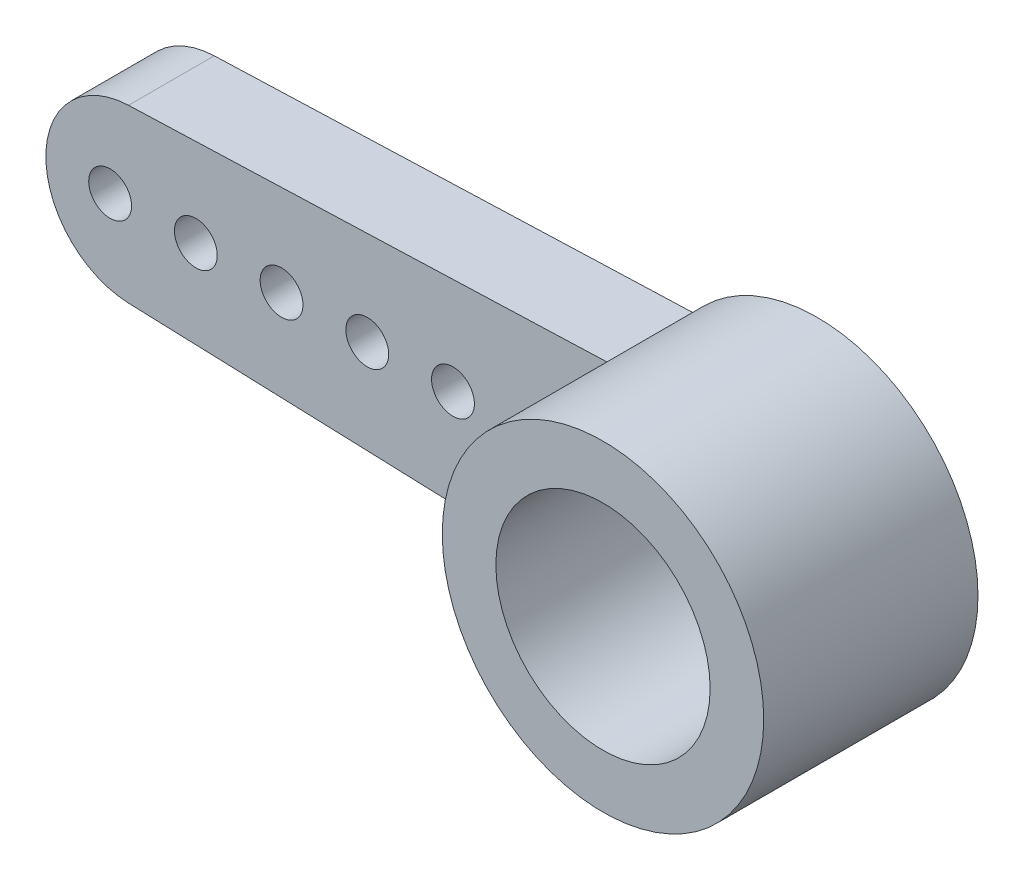
ISO-10303-21;
HEADER;
FILE_DESCRIPTION(('STEP AP214'),'2;1');
FILE_NAME('part.step','',(''),(''),'','','');
FILE_SCHEMA(('AUTOMOTIVE_DESIGN { 1 0 10303 214 1 1 1 1 }'));
ENDSEC;
DATA;
#1=APPLICATION_CONTEXT('core data for automotive mechanical design processes');
#2=APPLICATION_PROTOCOL_DEFINITION('international standard','automotive_design',2000,#1);
#3=PRODUCT_CONTEXT('',#1,'mechanical');
#4=PRODUCT('Part','Part','',(#3));
#5=PRODUCT_RELATED_PRODUCT_CATEGORY('part','',(#4));
#6=PRODUCT_DEFINITION_FORMATION('','',#4);
#7=PRODUCT_DEFINITION_CONTEXT('part definition',#1,'design');
#8=PRODUCT_DEFINITION('design','',#6,#7);
#9=PRODUCT_DEFINITION_SHAPE('','',#8);
#10=(LENGTH_UNIT() NAMED_UNIT(*) SI_UNIT(.MILLI.,.METRE.));
#11=(NAMED_UNIT(*) PLANE_ANGLE_UNIT() SI_UNIT($,.RADIAN.));
#12=(NAMED_UNIT(*) SI_UNIT($,.STERADIAN.) SOLID_ANGLE_UNIT());
#13=UNCERTAINTY_MEASURE_WITH_UNIT(LENGTH_MEASURE(1.E-05),#10,'distance_accuracy_value','');
#14=(GEOMETRIC_REPRESENTATION_CONTEXT(3) GLOBAL_UNCERTAINTY_ASSIGNED_CONTEXT((#13)) GLOBAL_UNIT_ASSIGNED_CONTEXT((#10,
#11,#12)) REPRESENTATION_CONTEXT('',''));
#15=CARTESIAN_POINT('',(0.,0.,0.));
#16=DIRECTION('',(0.,0.,1.));
#17=DIRECTION('',(1.,0.,0.));
#18=AXIS2_PLACEMENT_3D('',#15,#16,#17);
#19=CARTESIAN_POINT('',(0.,0.,0.));
#20=DIRECTION('',(0.,0.,1.));
#21=DIRECTION('',(1.,0.,0.));
#22=AXIS2_PLACEMENT_3D('',#19,#20,#21);
#23=PLANE('',#22);
#24=CARTESIAN_POINT('',(-14.5,0.,0.));
#25=DIRECTION('',(0.,0.,-1.));
#26=DIRECTION('',(-1.,0.,0.));
#27=AXIS2_PLACEMENT_3D('',#24,#25,#26);
#28=CIRCLE('',#27,0.500000000000001);
#29=CARTESIAN_POINT('',(-15.,0.,0.));
#30=VERTEX_POINT('',#29);
#31=EDGE_CURVE('E159',#30,#30,#28,.F.);
#32=ORIENTED_EDGE('',*,*,#31,.T.);
#33=EDGE_LOOP('',(#32));
#34=FACE_BOUND('',#33,.T.);
#35=CARTESIAN_POINT('',(-10.5,0.,0.));
#36=DIRECTION('',(0.,0.,-1.));
#37=DIRECTION('',(-1.,0.,0.));
#38=AXIS2_PLACEMENT_3D('',#35,#36,#37);
#39=CIRCLE('',#38,0.500000000000001);
#40=CARTESIAN_POINT('',(-11.,0.,0.));
#41=VERTEX_POINT('',#40);
#42=EDGE_CURVE('E147',#41,#41,#39,.F.);
#43=ORIENTED_EDGE('',*,*,#42,.T.);
#44=EDGE_LOOP('',(#43));
#45=FACE_BOUND('',#44,.T.);
#46=CARTESIAN_POINT('',(-6.5,0.,0.));
#47=DIRECTION('',(0.,0.,-1.));
#48=DIRECTION('',(-1.,0.,0.));
#49=AXIS2_PLACEMENT_3D('',#46,#47,#48);
#50=CIRCLE('',#49,0.500000000000001);
#51=CARTESIAN_POINT('',(-7.,0.,0.));
#52=VERTEX_POINT('',#51);
#53=EDGE_CURVE('E135',#52,#52,#50,.F.);
#54=ORIENTED_EDGE('',*,*,#53,.T.);
#55=EDGE_LOOP('',(#54));
#56=FACE_BOUND('',#55,.T.);
#57=CARTESIAN_POINT('',(-4.5,0.,0.));
#58=DIRECTION('',(0.,0.,-1.));
#59=DIRECTION('',(-1.,0.,0.));
#60=AXIS2_PLACEMENT_3D('',#57,#58,#59);
#61=CIRCLE('',#60,0.500000000000001);
#62=CARTESIAN_POINT('',(-5.,0.,0.));
#63=VERTEX_POINT('',#62);
#64=EDGE_CURVE('E131',#63,#63,#61,.F.);
#65=ORIENTED_EDGE('',*,*,#64,.T.);
#66=EDGE_LOOP('',(#65));
#67=FACE_BOUND('',#66,.T.);
#68=CARTESIAN_POINT('',(-8.5,0.,0.));
#69=DIRECTION('',(0.,0.,-1.));
#70=DIRECTION('',(-1.,0.,0.));
#71=AXIS2_PLACEMENT_3D('',#68,#69,#70);
#72=CIRCLE('',#71,0.500000000000001);
#73=CARTESIAN_POINT('',(-9.,0.,0.));
#74=VERTEX_POINT('',#73);
#75=EDGE_CURVE('E141',#74,#74,#72,.F.);
#76=ORIENTED_EDGE('',*,*,#75,.T.);
#77=EDGE_LOOP('',(#76));
#78=FACE_BOUND('',#77,.T.);
#79=CARTESIAN_POINT('',(-12.5,0.,0.));
#80=DIRECTION('',(0.,0.,-1.));
#81=DIRECTION('',(-1.,0.,0.));
#82=AXIS2_PLACEMENT_3D('',#79,#80,#81);
#83=CIRCLE('',#82,0.500000000000001);
#84=CARTESIAN_POINT('',(-13.,0.,0.));
#85=VERTEX_POINT('',#84);
#86=EDGE_CURVE('E153',#85,#85,#83,.F.);
#87=ORIENTED_EDGE('',*,*,#86,.T.);
#88=EDGE_LOOP('',(#87));
#89=FACE_BOUND('',#88,.T.);
#90=CARTESIAN_POINT('',(0.,0.,0.));
#91=DIRECTION('',(0.,0.,-1.));
#92=DIRECTION('',(-1.,0.,0.));
#93=AXIS2_PLACEMENT_3D('',#90,#91,#92);
#94=CIRCLE('',#93,2.5);
#95=CARTESIAN_POINT('',(-2.5,0.,0.));
#96=VERTEX_POINT('',#95);
#97=EDGE_CURVE('E171',#96,#96,#94,.T.);
#98=ORIENTED_EDGE('',*,*,#97,.F.);
#99=EDGE_LOOP('',(#98));
#100=FACE_BOUND('',#99,.T.);
#101=DIRECTION('',(0.999372730394994,0.0354139201848026,0.));
#102=VECTOR('',#101,1.);
#103=CARTESIAN_POINT('',(-0.0883858807695831,2.49422934631706,0.));
#104=LINE('',#103,#102);
#105=CARTESIAN_POINT('',(-14.0708278403696,1.99874546078999,0.));
#106=VERTEX_POINT('',#105);
#107=CARTESIAN_POINT('',(-2.88547071027724,2.39511143376089,0.));
#108=VERTEX_POINT('',#107);
#109=EDGE_CURVE('E119',#106,#108,#104,.T.);
#110=ORIENTED_EDGE('',*,*,#109,.T.);
#111=CARTESIAN_POINT('',(0.,0.,0.));
#112=DIRECTION('',(0.,0.,-1.));
#113=DIRECTION('',(-1.,0.,0.));
#114=AXIS2_PLACEMENT_3D('',#111,#112,#113);
#115=CIRCLE('',#114,3.75);
#116=CARTESIAN_POINT('',(-2.88547071027724,-2.39511143376089,0.));
#117=VERTEX_POINT('',#116);
#118=EDGE_CURVE('E48',#108,#117,#115,.T.);
#119=ORIENTED_EDGE('',*,*,#118,.T.);
#120=DIRECTION('',(0.999372730394994,-0.0354139201848024,0.));
#121=VECTOR('',#120,1.);
#122=CARTESIAN_POINT('',(-0.0883858807695825,-2.49422934631706,0.));
#123=LINE('',#122,#121);
#124=CARTESIAN_POINT('',(-14.0708278403696,-1.99874546078999,0.));
#125=VERTEX_POINT('',#124);
#126=EDGE_CURVE('E100',#125,#117,#123,.T.);
#127=ORIENTED_EDGE('',*,*,#126,.F.);
#128=CARTESIAN_POINT('',(-14.,0.,0.));
#129=DIRECTION('',(0.,0.,1.));
#130=DIRECTION('',(1.,0.,0.));
#131=AXIS2_PLACEMENT_3D('',#128,#129,#130);
#132=CIRCLE('',#131,2.);
#133=EDGE_CURVE('E122',#125,#106,#132,.F.);
#134=ORIENTED_EDGE('',*,*,#133,.T.);
#135=EDGE_LOOP('',(#110,#119,#127,#134));
#136=FACE_BOUND('',#135,.T.);
#137=ADVANCED_FACE('F40',(#34,#45,#56,#67,#78,#89,#100,#136),#23,.F.);
#138=CARTESIAN_POINT('',(0.,0.,0.));
#139=DIRECTION('',(0.,0.,1.));
#140=DIRECTION('',(1.,0.,0.));
#141=AXIS2_PLACEMENT_3D('',#138,#139,#140);
#142=CYLINDRICAL_SURFACE('',#141,2.5);
#143=CARTESIAN_POINT('',(0.,0.,5.));
#144=DIRECTION('',(0.,0.,1.));
#145=DIRECTION('',(1.,0.,0.));
#146=AXIS2_PLACEMENT_3D('',#143,#144,#145);
#147=CIRCLE('',#146,2.5);
#148=CARTESIAN_POINT('',(2.5,0.,5.));
#149=VERTEX_POINT('',#148);
#150=EDGE_CURVE('E128',#149,#149,#147,.T.);
#151=ORIENTED_EDGE('',*,*,#150,.T.);
#152=EDGE_LOOP('',(#151));
#153=FACE_BOUND('',#152,.T.);
#154=CARTESIAN_POINT('',(0.,0.,1.));
#155=DIRECTION('',(0.,0.,-1.));
#156=DIRECTION('',(-1.,0.,0.));
#157=AXIS2_PLACEMENT_3D('',#154,#155,#156);
#158=CIRCLE('',#157,2.5);
#159=CARTESIAN_POINT('',(-2.5,0.,1.));
#160=VERTEX_POINT('',#159);
#161=EDGE_CURVE('E165',#160,#160,#158,.T.);
#162=ORIENTED_EDGE('',*,*,#161,.T.);
#163=EDGE_LOOP('',(#162));
#164=FACE_BOUND('',#163,.T.);
#165=ADVANCED_FACE('F201',(#153,#164),#142,.F.);
#166=CARTESIAN_POINT('',(0.,0.,2.));
#167=DIRECTION('',(0.,0.,1.));
#168=DIRECTION('',(1.,0.,0.));
#169=AXIS2_PLACEMENT_3D('',#166,#167,#168);
#170=PLANE('',#169);
#171=CARTESIAN_POINT('',(-12.5,0.,2.));
#172=DIRECTION('',(0.,0.,-1.));
#173=DIRECTION('',(-1.,0.,0.));
#174=AXIS2_PLACEMENT_3D('',#171,#172,#173);
#175=CIRCLE('',#174,0.500000000000001);
#176=CARTESIAN_POINT('',(-13.,0.,2.));
#177=VERTEX_POINT('',#176);
#178=EDGE_CURVE('E156',#177,#177,#175,.F.);
#179=ORIENTED_EDGE('',*,*,#178,.F.);
#180=EDGE_LOOP('',(#179));
#181=FACE_BOUND('',#180,.T.);
#182=CARTESIAN_POINT('',(-8.5,0.,2.));
#183=DIRECTION('',(0.,0.,-1.));
#184=DIRECTION('',(-1.,0.,0.));
#185=AXIS2_PLACEMENT_3D('',#182,#183,#184);
#186=CIRCLE('',#185,0.500000000000001);
#187=CARTESIAN_POINT('',(-9.,0.,2.));
#188=VERTEX_POINT('',#187);
#189=EDGE_CURVE('E144',#188,#188,#186,.F.);
#190=ORIENTED_EDGE('',*,*,#189,.F.);
#191=EDGE_LOOP('',(#190));
#192=FACE_BOUND('',#191,.T.);
#193=CARTESIAN_POINT('',(-4.5,0.,2.));
#194=DIRECTION('',(0.,0.,-1.));
#195=DIRECTION('',(-1.,0.,0.));
#196=AXIS2_PLACEMENT_3D('',#193,#194,#195);
#197=CIRCLE('',#196,0.500000000000001);
#198=CARTESIAN_POINT('',(-5.,0.,2.));
#199=VERTEX_POINT('',#198);
#200=EDGE_CURVE('E132',#199,#199,#197,.F.);
#201=ORIENTED_EDGE('',*,*,#200,.F.);
#202=EDGE_LOOP('',(#201));
#203=FACE_BOUND('',#202,.T.);
#204=CARTESIAN_POINT('',(0.,0.,2.));
#205=DIRECTION('',(0.,0.,1.));
#206=DIRECTION('',(1.,0.,0.));
#207=AXIS2_PLACEMENT_3D('',#204,#205,#206);
#208=CIRCLE('',#207,3.75);
#209=CARTESIAN_POINT('',(-2.88547071027724,2.39511143376089,2.));
#210=VERTEX_POINT('',#209);
#211=CARTESIAN_POINT('',(-2.88547071027724,-2.39511143376089,2.));
#212=VERTEX_POINT('',#211);
#213=EDGE_CURVE('E12',#210,#212,#208,.T.);
#214=ORIENTED_EDGE('',*,*,#213,.F.);
#215=DIRECTION('',(0.999372730394994,0.0354139201848026,0.));
#216=VECTOR('',#215,1.);
#217=CARTESIAN_POINT('',(-0.0883858807695831,2.49422934631706,2.));
#218=LINE('',#217,#216);
#219=CARTESIAN_POINT('',(-14.0708278403696,1.99874546078999,2.));
#220=VERTEX_POINT('',#219);
#221=EDGE_CURVE('E95',#220,#210,#218,.T.);
#222=ORIENTED_EDGE('',*,*,#221,.F.);
#223=CARTESIAN_POINT('',(-14.,0.,2.));
#224=DIRECTION('',(0.,0.,1.));
#225=DIRECTION('',(1.,0.,0.));
#226=AXIS2_PLACEMENT_3D('',#223,#224,#225);
#227=CIRCLE('',#226,2.);
#228=CARTESIAN_POINT('',(-14.0708278403696,-1.99874546078999,2.));
#229=VERTEX_POINT('',#228);
#230=EDGE_CURVE('E93',#229,#220,#227,.F.);
#231=ORIENTED_EDGE('',*,*,#230,.F.);
#232=DIRECTION('',(0.999372730394994,-0.0354139201848024,0.));
#233=VECTOR('',#232,1.);
#234=CARTESIAN_POINT('',(-0.0883858807695825,-2.49422934631706,2.));
#235=LINE('',#234,#233);
#236=EDGE_CURVE('E88',#229,#212,#235,.T.);
#237=ORIENTED_EDGE('',*,*,#236,.T.);
#238=EDGE_LOOP('',(#214,#222,#231,#237));
#239=FACE_BOUND('',#238,.T.);
#240=CARTESIAN_POINT('',(-6.5,0.,2.));
#241=DIRECTION('',(0.,0.,-1.));
#242=DIRECTION('',(-1.,0.,0.));
#243=AXIS2_PLACEMENT_3D('',#240,#241,#242);
#244=CIRCLE('',#243,0.500000000000001);
#245=CARTESIAN_POINT('',(-7.,0.,2.));
#246=VERTEX_POINT('',#245);
#247=EDGE_CURVE('E138',#246,#246,#244,.F.);
#248=ORIENTED_EDGE('',*,*,#247,.F.);
#249=EDGE_LOOP('',(#248));
#250=FACE_BOUND('',#249,.T.);
#251=CARTESIAN_POINT('',(-10.5,0.,2.));
#252=DIRECTION('',(0.,0.,-1.));
#253=DIRECTION('',(-1.,0.,0.));
#254=AXIS2_PLACEMENT_3D('',#251,#252,#253);
#255=CIRCLE('',#254,0.500000000000001);
#256=CARTESIAN_POINT('',(-11.,0.,2.));
#257=VERTEX_POINT('',#256);
#258=EDGE_CURVE('E150',#257,#257,#255,.F.);
#259=ORIENTED_EDGE('',*,*,#258,.F.);
#260=EDGE_LOOP('',(#259));
#261=FACE_BOUND('',#260,.T.);
#262=CARTESIAN_POINT('',(-14.5,0.,2.));
#263=DIRECTION('',(0.,0.,-1.));
#264=DIRECTION('',(-1.,0.,0.));
#265=AXIS2_PLACEMENT_3D('',#262,#263,#264);
#266=CIRCLE('',#265,0.500000000000001);
#267=CARTESIAN_POINT('',(-15.,0.,2.));
#268=VERTEX_POINT('',#267);
#269=EDGE_CURVE('E162',#268,#268,#266,.F.);
#270=ORIENTED_EDGE('',*,*,#269,.F.);
#271=EDGE_LOOP('',(#270));
#272=FACE_BOUND('',#271,.T.);
#273=ADVANCED_FACE('F90',(#181,#192,#203,#239,#250,#261,#272),#170,.T.);
#274=CARTESIAN_POINT('',(0.,0.,0.));
#275=DIRECTION('',(0.,0.,1.));
#276=DIRECTION('',(1.,0.,0.));
#277=AXIS2_PLACEMENT_3D('',#274,#275,#276);
#278=CYLINDRICAL_SURFACE('',#277,3.75);
#279=ORIENTED_EDGE('',*,*,#118,.F.);
#280=DIRECTION('',(0.,0.,-1.));
#281=VECTOR('',#280,1.);
#282=CARTESIAN_POINT('',(-2.88547071027724,2.39511143376089,2.));
#283=LINE('',#282,#281);
#284=EDGE_CURVE('E101',#210,#108,#283,.T.);
#285=ORIENTED_EDGE('',*,*,#284,.F.);
#286=ORIENTED_EDGE('',*,*,#213,.T.);
#287=DIRECTION('',(0.,0.,-1.));
#288=VECTOR('',#287,1.);
#289=CARTESIAN_POINT('',(-2.88547071027724,-2.39511143376089,2.));
#290=LINE('',#289,#288);
#291=EDGE_CURVE('E97',#212,#117,#290,.T.);
#292=ORIENTED_EDGE('',*,*,#291,.T.);
#293=EDGE_LOOP('',(#279,#285,#286,#292));
#294=FACE_BOUND('',#293,.T.);
#295=CARTESIAN_POINT('',(0.,0.,5.));
#296=DIRECTION('',(0.,0.,1.));
#297=DIRECTION('',(1.,0.,0.));
#298=AXIS2_PLACEMENT_3D('',#295,#296,#297);
#299=CIRCLE('',#298,3.75);
#300=CARTESIAN_POINT('',(3.75,0.,5.));
#301=VERTEX_POINT('',#300);
#302=EDGE_CURVE('E124',#301,#301,#299,.T.);
#303=ORIENTED_EDGE('',*,*,#302,.F.);
#304=EDGE_LOOP('',(#303));
#305=FACE_BOUND('',#304,.T.);
#306=ADVANCED_FACE('F103',(#294,#305),#278,.T.);
#307=CARTESIAN_POINT('',(-14.,0.,2.));
#308=DIRECTION('',(0.,0.,-1.));
#309=DIRECTION('',(-1.,0.,0.));
#310=AXIS2_PLACEMENT_3D('',#307,#308,#309);
#311=CYLINDRICAL_SURFACE('',#310,2.);
#312=ORIENTED_EDGE('',*,*,#133,.F.);
#313=DIRECTION('',(0.,0.,-1.));
#314=VECTOR('',#313,1.);
#315=CARTESIAN_POINT('',(-14.0708278403696,-1.99874546078999,2.));
#316=LINE('',#315,#314);
#317=EDGE_CURVE('E83',#229,#125,#316,.T.);
#318=ORIENTED_EDGE('',*,*,#317,.F.);
#319=ORIENTED_EDGE('',*,*,#230,.T.);
#320=DIRECTION('',(0.,0.,-1.));
#321=VECTOR('',#320,1.);
#322=CARTESIAN_POINT('',(-14.0708278403696,1.99874546078999,2.));
#323=LINE('',#322,#321);
#324=EDGE_CURVE('E64',#220,#106,#323,.T.);
#325=ORIENTED_EDGE('',*,*,#324,.T.);
#326=EDGE_LOOP('',(#312,#318,#319,#325));
#327=FACE_BOUND('',#326,.T.);
#328=ADVANCED_FACE('F214',(#327),#311,.T.);
#329=CARTESIAN_POINT('',(-0.0883858807695825,-2.49422934631706,2.));
#330=DIRECTION('',(0.0354139201848024,0.999372730394994,0.));
#331=DIRECTION('',(-0.999372730394994,0.0354139201848024,0.));
#332=AXIS2_PLACEMENT_3D('',#329,#330,#331);
#333=PLANE('',#332);
#334=ORIENTED_EDGE('',*,*,#126,.T.);
#335=ORIENTED_EDGE('',*,*,#291,.F.);
#336=ORIENTED_EDGE('',*,*,#236,.F.);
#337=ORIENTED_EDGE('',*,*,#317,.T.);
#338=EDGE_LOOP('',(#334,#335,#336,#337));
#339=FACE_BOUND('',#338,.T.);
#340=ADVANCED_FACE('F98',(#339),#333,.F.);
#341=CARTESIAN_POINT('',(-0.0883858807695831,2.49422934631706,2.));
#342=DIRECTION('',(-0.0354139201848026,0.999372730394994,0.));
#343=DIRECTION('',(-0.999372730394994,-0.0354139201848026,0.));
#344=AXIS2_PLACEMENT_3D('',#341,#342,#343);
#345=PLANE('',#344);
#346=ORIENTED_EDGE('',*,*,#109,.F.);
#347=ORIENTED_EDGE('',*,*,#324,.F.);
#348=ORIENTED_EDGE('',*,*,#221,.T.);
#349=ORIENTED_EDGE('',*,*,#284,.T.);
#350=EDGE_LOOP('',(#346,#347,#348,#349));
#351=FACE_BOUND('',#350,.T.);
#352=ADVANCED_FACE('F203',(#351),#345,.T.);
#353=CARTESIAN_POINT('',(0.,0.,5.));
#354=DIRECTION('',(0.,0.,1.));
#355=DIRECTION('',(1.,0.,0.));
#356=AXIS2_PLACEMENT_3D('',#353,#354,#355);
#357=PLANE('',#356);
#358=ORIENTED_EDGE('',*,*,#302,.T.);
#359=EDGE_LOOP('',(#358));
#360=FACE_BOUND('',#359,.T.);
#361=ORIENTED_EDGE('',*,*,#150,.F.);
#362=EDGE_LOOP('',(#361));
#363=FACE_BOUND('',#362,.T.);
#364=ADVANCED_FACE('F205',(#360,#363),#357,.T.);
#365=CARTESIAN_POINT('',(-4.5,0.,2.));
#366=DIRECTION('',(0.,0.,-1.));
#367=DIRECTION('',(-1.,0.,0.));
#368=AXIS2_PLACEMENT_3D('',#365,#366,#367);
#369=CYLINDRICAL_SURFACE('',#368,0.500000000000001);
#370=ORIENTED_EDGE('',*,*,#200,.T.);
#371=EDGE_LOOP('',(#370));
#372=FACE_BOUND('',#371,.T.);
#373=ORIENTED_EDGE('',*,*,#64,.F.);
#374=EDGE_LOOP('',(#373));
#375=FACE_BOUND('',#374,.T.);
#376=ADVANCED_FACE('F211',(#372,#375),#369,.F.);
#377=CARTESIAN_POINT('',(-6.5,0.,2.));
#378=DIRECTION('',(0.,0.,-1.));
#379=DIRECTION('',(-1.,0.,0.));
#380=AXIS2_PLACEMENT_3D('',#377,#378,#379);
#381=CYLINDRICAL_SURFACE('',#380,0.500000000000001);
#382=ORIENTED_EDGE('',*,*,#247,.T.);
#383=EDGE_LOOP('',(#382));
#384=FACE_BOUND('',#383,.T.);
#385=ORIENTED_EDGE('',*,*,#53,.F.);
#386=EDGE_LOOP('',(#385));
#387=FACE_BOUND('',#386,.T.);
#388=ADVANCED_FACE('F236',(#384,#387),#381,.F.);
#389=CARTESIAN_POINT('',(-8.5,0.,2.));
#390=DIRECTION('',(0.,0.,-1.));
#391=DIRECTION('',(-1.,0.,0.));
#392=AXIS2_PLACEMENT_3D('',#389,#390,#391);
#393=CYLINDRICAL_SURFACE('',#392,0.500000000000001);
#394=ORIENTED_EDGE('',*,*,#189,.T.);
#395=EDGE_LOOP('',(#394));
#396=FACE_BOUND('',#395,.T.);
#397=ORIENTED_EDGE('',*,*,#75,.F.);
#398=EDGE_LOOP('',(#397));
#399=FACE_BOUND('',#398,.T.);
#400=ADVANCED_FACE('F256',(#396,#399),#393,.F.);
#401=CARTESIAN_POINT('',(-10.5,0.,2.));
#402=DIRECTION('',(0.,0.,-1.));
#403=DIRECTION('',(-1.,0.,0.));
#404=AXIS2_PLACEMENT_3D('',#401,#402,#403);
#405=CYLINDRICAL_SURFACE('',#404,0.500000000000001);
#406=ORIENTED_EDGE('',*,*,#258,.T.);
#407=EDGE_LOOP('',(#406));
#408=FACE_BOUND('',#407,.T.);
#409=ORIENTED_EDGE('',*,*,#42,.F.);
#410=EDGE_LOOP('',(#409));
#411=FACE_BOUND('',#410,.T.);
#412=ADVANCED_FACE('F247',(#408,#411),#405,.F.);
#413=CARTESIAN_POINT('',(-12.5,0.,2.));
#414=DIRECTION('',(0.,0.,-1.));
#415=DIRECTION('',(-1.,0.,0.));
#416=AXIS2_PLACEMENT_3D('',#413,#414,#415);
#417=CYLINDRICAL_SURFACE('',#416,0.500000000000001);
#418=ORIENTED_EDGE('',*,*,#178,.T.);
#419=EDGE_LOOP('',(#418));
#420=FACE_BOUND('',#419,.T.);
#421=ORIENTED_EDGE('',*,*,#86,.F.);
#422=EDGE_LOOP('',(#421));
#423=FACE_BOUND('',#422,.T.);
#424=ADVANCED_FACE('F244',(#420,#423),#417,.F.);
#425=CARTESIAN_POINT('',(-14.5,0.,2.));
#426=DIRECTION('',(0.,0.,-1.));
#427=DIRECTION('',(-1.,0.,0.));
#428=AXIS2_PLACEMENT_3D('',#425,#426,#427);
#429=CYLINDRICAL_SURFACE('',#428,0.500000000000001);
#430=ORIENTED_EDGE('',*,*,#269,.T.);
#431=EDGE_LOOP('',(#430));
#432=FACE_BOUND('',#431,.T.);
#433=ORIENTED_EDGE('',*,*,#31,.F.);
#434=EDGE_LOOP('',(#433));
#435=FACE_BOUND('',#434,.T.);
#436=ADVANCED_FACE('F246',(#432,#435),#429,.F.);
#437=CARTESIAN_POINT('',(0.,0.,1.));
#438=DIRECTION('',(0.,0.,-1.));
#439=DIRECTION('',(-1.,0.,0.));
#440=AXIS2_PLACEMENT_3D('',#437,#438,#439);
#441=PLANE('',#440);
#442=CARTESIAN_POINT('',(0.,0.,1.));
#443=DIRECTION('',(0.,0.,-1.));
#444=DIRECTION('',(-1.,0.,0.));
#445=AXIS2_PLACEMENT_3D('',#442,#443,#444);
#446=CIRCLE('',#445,1.25);
#447=CARTESIAN_POINT('',(-1.25,0.,1.));
#448=VERTEX_POINT('',#447);
#449=EDGE_CURVE('E174',#448,#448,#446,.T.);
#450=ORIENTED_EDGE('',*,*,#449,.T.);
#451=EDGE_LOOP('',(#450));
#452=FACE_BOUND('',#451,.T.);
#453=ORIENTED_EDGE('',*,*,#161,.F.);
#454=EDGE_LOOP('',(#453));
#455=FACE_BOUND('',#454,.T.);
#456=ADVANCED_FACE('F195',(#452,#455),#441,.F.);
#457=CARTESIAN_POINT('',(0.,0.,0.5));
#458=DIRECTION('',(0.,0.,-1.));
#459=DIRECTION('',(-1.,0.,0.));
#460=AXIS2_PLACEMENT_3D('',#457,#458,#459);
#461=CYLINDRICAL_SURFACE('',#460,2.5);
#462=CARTESIAN_POINT('',(0.,0.,0.5));
#463=DIRECTION('',(0.,0.,-1.));
#464=DIRECTION('',(-1.,0.,0.));
#465=AXIS2_PLACEMENT_3D('',#462,#463,#464);
#466=CIRCLE('',#465,2.5);
#467=CARTESIAN_POINT('',(-2.5,0.,0.5));
#468=VERTEX_POINT('',#467);
#469=EDGE_CURVE('E170',#468,#468,#466,.T.);
#470=ORIENTED_EDGE('',*,*,#469,.F.);
#471=EDGE_LOOP('',(#470));
#472=FACE_BOUND('',#471,.T.);
#473=ORIENTED_EDGE('',*,*,#97,.T.);
#474=EDGE_LOOP('',(#473));
#475=FACE_BOUND('',#474,.T.);
#476=ADVANCED_FACE('F189',(#472,#475),#461,.F.);
#477=CARTESIAN_POINT('',(0.,0.,0.5));
#478=DIRECTION('',(0.,0.,-1.));
#479=DIRECTION('',(-1.,0.,0.));
#480=AXIS2_PLACEMENT_3D('',#477,#478,#479);
#481=PLANE('',#480);
#482=CARTESIAN_POINT('',(0.,0.,0.5));
#483=DIRECTION('',(0.,0.,-1.));
#484=DIRECTION('',(-1.,0.,0.));
#485=AXIS2_PLACEMENT_3D('',#482,#483,#484);
#486=CIRCLE('',#485,1.25);
#487=CARTESIAN_POINT('',(-1.25,0.,0.5));
#488=VERTEX_POINT('',#487);
#489=EDGE_CURVE('E179',#488,#488,#486,.T.);
#490=ORIENTED_EDGE('',*,*,#489,.F.);
#491=EDGE_LOOP('',(#490));
#492=FACE_BOUND('',#491,.T.);
#493=ORIENTED_EDGE('',*,*,#469,.T.);
#494=EDGE_LOOP('',(#493));
#495=FACE_BOUND('',#494,.T.);
#496=ADVANCED_FACE('F186',(#492,#495),#481,.T.);
#497=CARTESIAN_POINT('',(0.,0.,5.5));
#498=DIRECTION('',(0.,0.,-1.));
#499=DIRECTION('',(-1.,0.,0.));
#500=AXIS2_PLACEMENT_3D('',#497,#498,#499);
#501=CYLINDRICAL_SURFACE('',#500,1.25);
#502=ORIENTED_EDGE('',*,*,#489,.T.);
#503=EDGE_LOOP('',(#502));
#504=FACE_BOUND('',#503,.T.);
#505=ORIENTED_EDGE('',*,*,#449,.F.);
#506=EDGE_LOOP('',(#505));
#507=FACE_BOUND('',#506,.T.);
#508=ADVANCED_FACE('F183',(#504,#507),#501,.F.);
#509=CLOSED_SHELL('',(#137,#165,#273,#306,#328,#340,#352,#364,#376,#388,#400,#412,#424,#436,
#456,#476,#496,#508));
#510=MANIFOLD_SOLID_BREP('B2',#509);
#511=ADVANCED_BREP_SHAPE_REPRESENTATION('',(#18,#510),#14);
#512=SHAPE_DEFINITION_REPRESENTATION(#9,#511);
ENDSEC;
END-ISO-10303-21;
